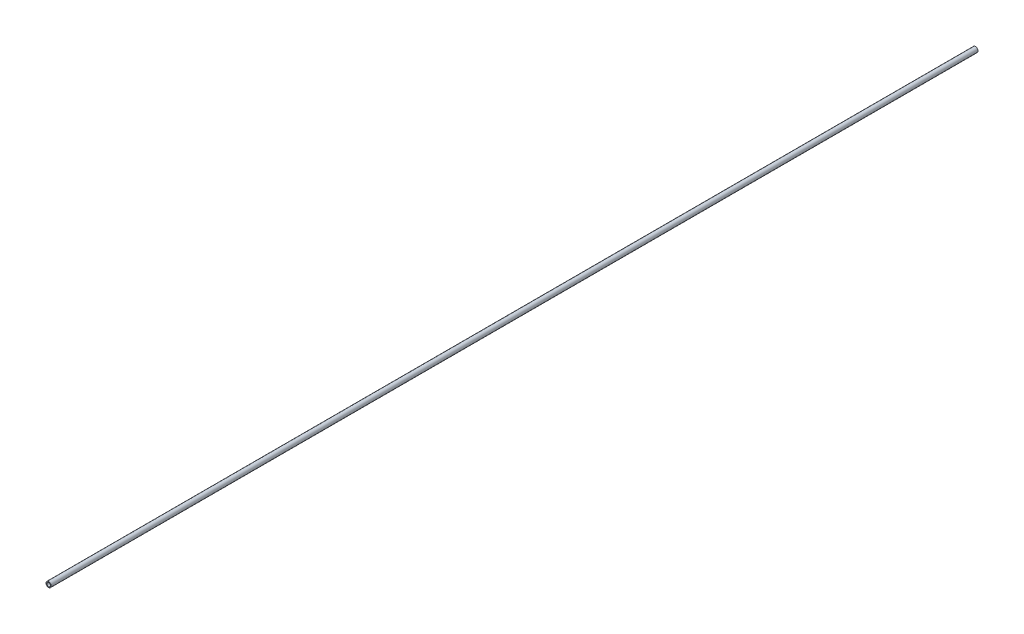
ISO-10303-21;
HEADER;
FILE_DESCRIPTION(('STEP AP214'),'2;1');
FILE_NAME('part.step','',(''),(''),'','','');
FILE_SCHEMA(('AUTOMOTIVE_DESIGN { 1 0 10303 214 1 1 1 1 }'));
ENDSEC;
DATA;
#1=APPLICATION_CONTEXT('core data for automotive mechanical design processes');
#2=APPLICATION_PROTOCOL_DEFINITION('international standard','automotive_design',2000,#1);
#3=PRODUCT_CONTEXT('',#1,'mechanical');
#4=PRODUCT('Part','Part','',(#3));
#5=PRODUCT_RELATED_PRODUCT_CATEGORY('part','',(#4));
#6=PRODUCT_DEFINITION_FORMATION('','',#4);
#7=PRODUCT_DEFINITION_CONTEXT('part definition',#1,'design');
#8=PRODUCT_DEFINITION('design','',#6,#7);
#9=PRODUCT_DEFINITION_SHAPE('','',#8);
#10=(LENGTH_UNIT() NAMED_UNIT(*) SI_UNIT(.MILLI.,.METRE.));
#11=(NAMED_UNIT(*) PLANE_ANGLE_UNIT() SI_UNIT($,.RADIAN.));
#12=(NAMED_UNIT(*) SI_UNIT($,.STERADIAN.) SOLID_ANGLE_UNIT());
#13=UNCERTAINTY_MEASURE_WITH_UNIT(LENGTH_MEASURE(1.E-05),#10,'distance_accuracy_value','');
#14=(GEOMETRIC_REPRESENTATION_CONTEXT(3) GLOBAL_UNCERTAINTY_ASSIGNED_CONTEXT((#13)) GLOBAL_UNIT_ASSIGNED_CONTEXT((#10,
#11,#12)) REPRESENTATION_CONTEXT('',''));
#15=CARTESIAN_POINT('',(0.,0.,0.));
#16=DIRECTION('',(0.,0.,1.));
#17=DIRECTION('',(1.,0.,0.));
#18=AXIS2_PLACEMENT_3D('',#15,#16,#17);
#19=CARTESIAN_POINT('',(0.,0.,-1229.52888776));
#20=DIRECTION('',(0.,0.,1.));
#21=DIRECTION('',(1.,0.,0.));
#22=AXIS2_PLACEMENT_3D('',#19,#20,#21);
#23=CYLINDRICAL_SURFACE('',#22,6.83635542);
#24=CARTESIAN_POINT('',(0.,0.,-1229.52888776));
#25=DIRECTION('',(0.,0.,1.));
#26=DIRECTION('',(1.,0.,0.));
#27=AXIS2_PLACEMENT_3D('',#24,#25,#26);
#28=CIRCLE('',#27,6.83635542);
#29=CARTESIAN_POINT('',(6.83635542,0.,-1229.52888776));
#30=VERTEX_POINT('',#29);
#31=EDGE_CURVE('E10',#30,#30,#28,.T.);
#32=ORIENTED_EDGE('',*,*,#31,.T.);
#33=EDGE_LOOP('',(#32));
#34=FACE_BOUND('',#33,.T.);
#35=CARTESIAN_POINT('',(0.,0.,1229.52888776));
#36=DIRECTION('',(0.,0.,1.));
#37=DIRECTION('',(1.,0.,0.));
#38=AXIS2_PLACEMENT_3D('',#35,#36,#37);
#39=CIRCLE('',#38,6.83635542);
#40=CARTESIAN_POINT('',(6.83635542,0.,1229.52888776));
#41=VERTEX_POINT('',#40);
#42=EDGE_CURVE('E45',#41,#41,#39,.T.);
#43=ORIENTED_EDGE('',*,*,#42,.F.);
#44=EDGE_LOOP('',(#43));
#45=FACE_BOUND('',#44,.T.);
#46=ADVANCED_FACE('F35',(#34,#45),#23,.T.);
#47=CARTESIAN_POINT('',(0.,0.,-1229.52888776));
#48=DIRECTION('',(0.,0.,1.));
#49=DIRECTION('',(1.,0.,0.));
#50=AXIS2_PLACEMENT_3D('',#47,#48,#49);
#51=PLANE('',#50);
#52=CARTESIAN_POINT('',(0.,0.,-1229.52888776));
#53=DIRECTION('',(0.,0.,1.));
#54=DIRECTION('',(1.,0.,0.));
#55=AXIS2_PLACEMENT_3D('',#52,#53,#54);
#56=CIRCLE('',#55,4.83635542);
#57=CARTESIAN_POINT('',(4.83635542,0.,-1229.52888776));
#58=VERTEX_POINT('',#57);
#59=EDGE_CURVE('E41',#58,#58,#56,.T.);
#60=ORIENTED_EDGE('',*,*,#59,.T.);
#61=EDGE_LOOP('',(#60));
#62=FACE_BOUND('',#61,.T.);
#63=ORIENTED_EDGE('',*,*,#31,.F.);
#64=EDGE_LOOP('',(#63));
#65=FACE_BOUND('',#64,.T.);
#66=ADVANCED_FACE('F64',(#62,#65),#51,.F.);
#67=CARTESIAN_POINT('',(0.,0.,-1229.52888776));
#68=DIRECTION('',(0.,0.,1.));
#69=DIRECTION('',(1.,0.,0.));
#70=AXIS2_PLACEMENT_3D('',#67,#68,#69);
#71=CYLINDRICAL_SURFACE('',#70,4.83635542);
#72=ORIENTED_EDGE('',*,*,#59,.F.);
#73=EDGE_LOOP('',(#72));
#74=FACE_BOUND('',#73,.T.);
#75=CARTESIAN_POINT('',(0.,0.,1229.52888776));
#76=DIRECTION('',(0.,0.,1.));
#77=DIRECTION('',(1.,0.,0.));
#78=AXIS2_PLACEMENT_3D('',#75,#76,#77);
#79=CIRCLE('',#78,4.83635542);
#80=CARTESIAN_POINT('',(4.83635542,0.,1229.52888776));
#81=VERTEX_POINT('',#80);
#82=EDGE_CURVE('E49',#81,#81,#79,.T.);
#83=ORIENTED_EDGE('',*,*,#82,.T.);
#84=EDGE_LOOP('',(#83));
#85=FACE_BOUND('',#84,.T.);
#86=ADVANCED_FACE('F55',(#74,#85),#71,.F.);
#87=CARTESIAN_POINT('',(0.,0.,1229.52888776));
#88=DIRECTION('',(0.,0.,1.));
#89=DIRECTION('',(1.,0.,0.));
#90=AXIS2_PLACEMENT_3D('',#87,#88,#89);
#91=PLANE('',#90);
#92=ORIENTED_EDGE('',*,*,#42,.T.);
#93=EDGE_LOOP('',(#92));
#94=FACE_BOUND('',#93,.T.);
#95=ORIENTED_EDGE('',*,*,#82,.F.);
#96=EDGE_LOOP('',(#95));
#97=FACE_BOUND('',#96,.T.);
#98=ADVANCED_FACE('F57',(#94,#97),#91,.T.);
#99=CLOSED_SHELL('',(#46,#66,#86,#98));
#100=MANIFOLD_SOLID_BREP('B2',#99);
#101=ADVANCED_BREP_SHAPE_REPRESENTATION('',(#18,#100),#14);
#102=SHAPE_DEFINITION_REPRESENTATION(#9,#101);
ENDSEC;
END-ISO-10303-21;
